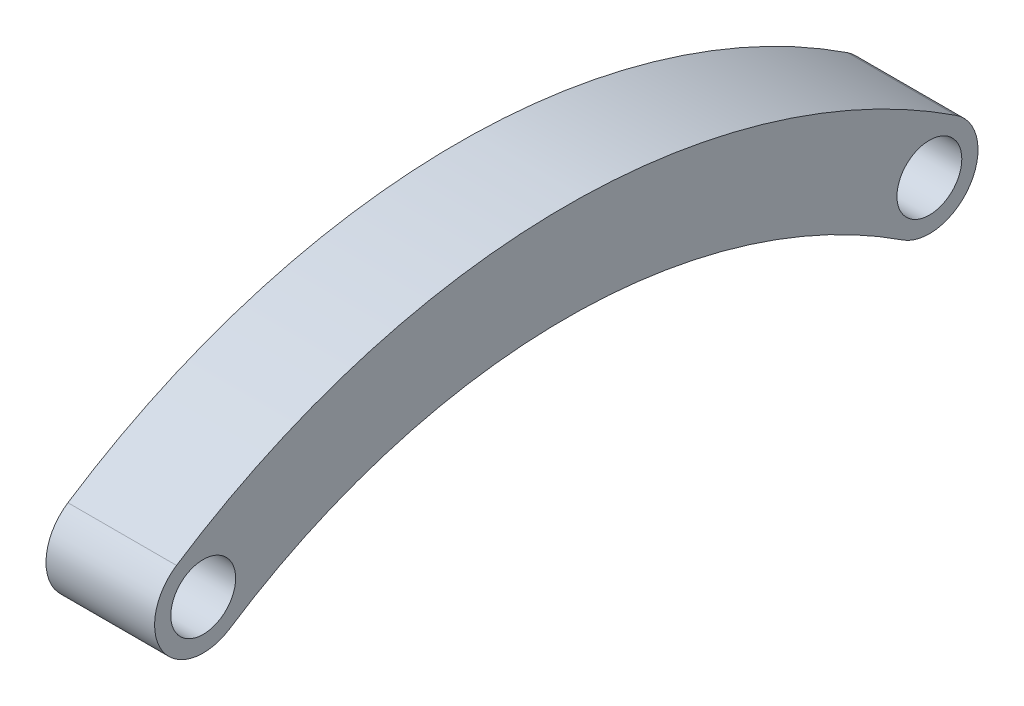
ISO-10303-21;
HEADER;
FILE_DESCRIPTION(('STEP AP214'),'2;1');
FILE_NAME('part.step','',(''),(''),'','','');
FILE_SCHEMA(('AUTOMOTIVE_DESIGN { 1 0 10303 214 1 1 1 1 }'));
ENDSEC;
DATA;
#1=APPLICATION_CONTEXT('core data for automotive mechanical design processes');
#2=APPLICATION_PROTOCOL_DEFINITION('international standard','automotive_design',2000,#1);
#3=PRODUCT_CONTEXT('',#1,'mechanical');
#4=PRODUCT('Part','Part','',(#3));
#5=PRODUCT_RELATED_PRODUCT_CATEGORY('part','',(#4));
#6=PRODUCT_DEFINITION_FORMATION('','',#4);
#7=PRODUCT_DEFINITION_CONTEXT('part definition',#1,'design');
#8=PRODUCT_DEFINITION('design','',#6,#7);
#9=PRODUCT_DEFINITION_SHAPE('','',#8);
#10=(LENGTH_UNIT() NAMED_UNIT(*) SI_UNIT(.MILLI.,.METRE.));
#11=(NAMED_UNIT(*) PLANE_ANGLE_UNIT() SI_UNIT($,.RADIAN.));
#12=(NAMED_UNIT(*) SI_UNIT($,.STERADIAN.) SOLID_ANGLE_UNIT());
#13=UNCERTAINTY_MEASURE_WITH_UNIT(LENGTH_MEASURE(1.E-05),#10,'distance_accuracy_value','');
#14=(GEOMETRIC_REPRESENTATION_CONTEXT(3) GLOBAL_UNCERTAINTY_ASSIGNED_CONTEXT((#13)) GLOBAL_UNIT_ASSIGNED_CONTEXT((#10,
#11,#12)) REPRESENTATION_CONTEXT('',''));
#15=CARTESIAN_POINT('',(0.,0.,0.));
#16=DIRECTION('',(0.,0.,1.));
#17=DIRECTION('',(1.,0.,0.));
#18=AXIS2_PLACEMENT_3D('',#15,#16,#17);
#19=CARTESIAN_POINT('',(3.35,-3.69999999999996,-22.4));
#20=DIRECTION('',(-1.,0.,0.));
#21=DIRECTION('',(0.,0.,1.));
#22=AXIS2_PLACEMENT_3D('',#19,#20,#21);
#23=CYLINDRICAL_SURFACE('',#22,3.);
#24=CARTESIAN_POINT('',(-3.35,-3.69999999999996,-22.4));
#25=DIRECTION('',(1.,0.,0.));
#26=DIRECTION('',(0.,0.,-1.));
#27=AXIS2_PLACEMENT_3D('',#24,#25,#26);
#28=CIRCLE('',#27,3.);
#29=CARTESIAN_POINT('',(-3.35,-6.20728985639803,-20.7527302661666));
#30=VERTEX_POINT('',#29);
#31=CARTESIAN_POINT('',(-3.35,-1.19271014360174,-24.0472697338334));
#32=VERTEX_POINT('',#31);
#33=EDGE_CURVE('E112',#30,#32,#28,.T.);
#34=ORIENTED_EDGE('',*,*,#33,.T.);
#35=DIRECTION('',(-1.,0.,0.));
#36=VECTOR('',#35,1.);
#37=CARTESIAN_POINT('',(3.35,-1.19271014360174,-24.0472697338334));
#38=LINE('',#37,#36);
#39=CARTESIAN_POINT('',(3.35,-1.19271014360174,-24.0472697338334));
#40=VERTEX_POINT('',#39);
#41=EDGE_CURVE('E11',#40,#32,#38,.T.);
#42=ORIENTED_EDGE('',*,*,#41,.F.);
#43=CARTESIAN_POINT('',(3.35,-3.69999999999996,-22.4));
#44=DIRECTION('',(1.,0.,0.));
#45=DIRECTION('',(0.,0.,-1.));
#46=AXIS2_PLACEMENT_3D('',#43,#44,#45);
#47=CIRCLE('',#46,3.);
#48=CARTESIAN_POINT('',(3.35,-6.20728985639803,-20.7527302661666));
#49=VERTEX_POINT('',#48);
#50=EDGE_CURVE('E94',#49,#40,#47,.T.);
#51=ORIENTED_EDGE('',*,*,#50,.F.);
#52=DIRECTION('',(-1.,0.,0.));
#53=VECTOR('',#52,1.);
#54=CARTESIAN_POINT('',(3.35,-6.20728985639803,-20.7527302661666));
#55=LINE('',#54,#53);
#56=EDGE_CURVE('E108',#49,#30,#55,.T.);
#57=ORIENTED_EDGE('',*,*,#56,.T.);
#58=EDGE_LOOP('',(#34,#42,#51,#57));
#59=FACE_BOUND('',#58,.T.);
#60=ADVANCED_FACE('F43',(#59),#23,.T.);
#61=CARTESIAN_POINT('',(3.35,-37.7947761194029,0.));
#62=DIRECTION('',(-1.,0.,0.));
#63=DIRECTION('',(0.,0.,1.));
#64=AXIS2_PLACEMENT_3D('',#61,#62,#63);
#65=CYLINDRICAL_SURFACE('',#64,43.7947761194032);
#66=CARTESIAN_POINT('',(-3.35,-37.7947761194029,0.));
#67=DIRECTION('',(1.,0.,0.));
#68=DIRECTION('',(0.,0.,-1.));
#69=AXIS2_PLACEMENT_3D('',#66,#67,#68);
#70=CIRCLE('',#69,43.7947761194032);
#71=CARTESIAN_POINT('',(-3.35,-1.1927101436019,24.0472697338333));
#72=VERTEX_POINT('',#71);
#73=EDGE_CURVE('E100',#32,#72,#70,.T.);
#74=ORIENTED_EDGE('',*,*,#73,.T.);
#75=DIRECTION('',(-1.,0.,0.));
#76=VECTOR('',#75,1.);
#77=CARTESIAN_POINT('',(3.35,-1.1927101436019,24.0472697338333));
#78=LINE('',#77,#76);
#79=CARTESIAN_POINT('',(3.35,-1.1927101436019,24.0472697338333));
#80=VERTEX_POINT('',#79);
#81=EDGE_CURVE('E52',#80,#72,#78,.T.);
#82=ORIENTED_EDGE('',*,*,#81,.F.);
#83=CARTESIAN_POINT('',(3.35,-37.7947761194029,0.));
#84=DIRECTION('',(1.,0.,0.));
#85=DIRECTION('',(0.,0.,1.));
#86=AXIS2_PLACEMENT_3D('',#83,#84,#85);
#87=CIRCLE('',#86,43.7947761194032);
#88=EDGE_CURVE('E88',#40,#80,#87,.T.);
#89=ORIENTED_EDGE('',*,*,#88,.F.);
#90=ORIENTED_EDGE('',*,*,#41,.T.);
#91=EDGE_LOOP('',(#74,#82,#89,#90));
#92=FACE_BOUND('',#91,.T.);
#93=ADVANCED_FACE('F99',(#92),#65,.T.);
#94=CARTESIAN_POINT('',(3.35,-3.69999999999996,22.4));
#95=DIRECTION('',(-1.,0.,0.));
#96=DIRECTION('',(0.,0.,1.));
#97=AXIS2_PLACEMENT_3D('',#94,#95,#96);
#98=CYLINDRICAL_SURFACE('',#97,3.);
#99=CARTESIAN_POINT('',(-3.35,-3.69999999999996,22.4));
#100=DIRECTION('',(1.,0.,0.));
#101=DIRECTION('',(0.,0.,1.));
#102=AXIS2_PLACEMENT_3D('',#99,#100,#101);
#103=CIRCLE('',#102,3.);
#104=CARTESIAN_POINT('',(-3.35,-6.20728985639803,20.7527302661666));
#105=VERTEX_POINT('',#104);
#106=EDGE_CURVE('E119',#72,#105,#103,.T.);
#107=ORIENTED_EDGE('',*,*,#106,.T.);
#108=DIRECTION('',(-1.,0.,0.));
#109=VECTOR('',#108,1.);
#110=CARTESIAN_POINT('',(3.35,-6.20728985639803,20.7527302661666));
#111=LINE('',#110,#109);
#112=CARTESIAN_POINT('',(3.35,-6.20728985639803,20.7527302661666));
#113=VERTEX_POINT('',#112);
#114=EDGE_CURVE('E103',#113,#105,#111,.T.);
#115=ORIENTED_EDGE('',*,*,#114,.F.);
#116=CARTESIAN_POINT('',(3.35,-3.69999999999996,22.4));
#117=DIRECTION('',(1.,0.,0.));
#118=DIRECTION('',(0.,0.,1.));
#119=AXIS2_PLACEMENT_3D('',#116,#117,#118);
#120=CIRCLE('',#119,3.);
#121=EDGE_CURVE('E91',#80,#113,#120,.T.);
#122=ORIENTED_EDGE('',*,*,#121,.F.);
#123=ORIENTED_EDGE('',*,*,#81,.T.);
#124=EDGE_LOOP('',(#107,#115,#122,#123));
#125=FACE_BOUND('',#124,.T.);
#126=ADVANCED_FACE('F104',(#125),#98,.T.);
#127=CARTESIAN_POINT('',(3.35,-37.7947761194029,0.));
#128=DIRECTION('',(-1.,0.,0.));
#129=DIRECTION('',(0.,0.,1.));
#130=AXIS2_PLACEMENT_3D('',#127,#128,#129);
#131=CYLINDRICAL_SURFACE('',#130,37.794776119403);
#132=CARTESIAN_POINT('',(-3.35,-37.7947761194029,0.));
#133=DIRECTION('',(-1.,0.,0.));
#134=DIRECTION('',(0.,0.,1.));
#135=AXIS2_PLACEMENT_3D('',#132,#133,#134);
#136=CIRCLE('',#135,37.794776119403);
#137=EDGE_CURVE('E77',#105,#30,#136,.T.);
#138=ORIENTED_EDGE('',*,*,#137,.T.);
#139=ORIENTED_EDGE('',*,*,#56,.F.);
#140=CARTESIAN_POINT('',(3.35,-37.7947761194029,0.));
#141=DIRECTION('',(-1.,0.,0.));
#142=DIRECTION('',(0.,0.,-1.));
#143=AXIS2_PLACEMENT_3D('',#140,#141,#142);
#144=CIRCLE('',#143,37.794776119403);
#145=EDGE_CURVE('E60',#113,#49,#144,.T.);
#146=ORIENTED_EDGE('',*,*,#145,.F.);
#147=ORIENTED_EDGE('',*,*,#114,.T.);
#148=EDGE_LOOP('',(#138,#139,#146,#147));
#149=FACE_BOUND('',#148,.T.);
#150=ADVANCED_FACE('F127',(#149),#131,.F.);
#151=CARTESIAN_POINT('',(3.35,-20.7473880597014,-11.2));
#152=DIRECTION('',(1.,0.,0.));
#153=DIRECTION('',(0.,0.,-1.));
#154=AXIS2_PLACEMENT_3D('',#151,#152,#153);
#155=PLANE('',#154);
#156=CARTESIAN_POINT('',(3.35,-3.69999999999996,22.4));
#157=DIRECTION('',(1.,0.,0.));
#158=DIRECTION('',(0.,0.,-1.));
#159=AXIS2_PLACEMENT_3D('',#156,#157,#158);
#160=CIRCLE('',#159,2.);
#161=CARTESIAN_POINT('',(3.35,-3.69999999999996,20.4));
#162=VERTEX_POINT('',#161);
#163=EDGE_CURVE('E135',#162,#162,#160,.T.);
#164=ORIENTED_EDGE('',*,*,#163,.F.);
#165=EDGE_LOOP('',(#164));
#166=FACE_BOUND('',#165,.T.);
#167=CARTESIAN_POINT('',(3.35,-3.69999999999996,-22.4));
#168=DIRECTION('',(1.,0.,0.));
#169=DIRECTION('',(0.,0.,1.));
#170=AXIS2_PLACEMENT_3D('',#167,#168,#169);
#171=CIRCLE('',#170,2.);
#172=CARTESIAN_POINT('',(3.35,-3.69999999999996,-20.4));
#173=VERTEX_POINT('',#172);
#174=EDGE_CURVE('E131',#173,#173,#171,.T.);
#175=ORIENTED_EDGE('',*,*,#174,.F.);
#176=EDGE_LOOP('',(#175));
#177=FACE_BOUND('',#176,.T.);
#178=ORIENTED_EDGE('',*,*,#50,.T.);
#179=ORIENTED_EDGE('',*,*,#88,.T.);
#180=ORIENTED_EDGE('',*,*,#121,.T.);
#181=ORIENTED_EDGE('',*,*,#145,.T.);
#182=EDGE_LOOP('',(#178,#179,#180,#181));
#183=FACE_BOUND('',#182,.T.);
#184=ADVANCED_FACE('F89',(#166,#177,#183),#155,.T.);
#185=CARTESIAN_POINT('',(-3.35,-20.7473880597014,-11.2));
#186=DIRECTION('',(1.,0.,0.));
#187=DIRECTION('',(0.,0.,-1.));
#188=AXIS2_PLACEMENT_3D('',#185,#186,#187);
#189=PLANE('',#188);
#190=CARTESIAN_POINT('',(-3.35,-3.69999999999996,22.4));
#191=DIRECTION('',(1.,0.,0.));
#192=DIRECTION('',(0.,0.,-1.));
#193=AXIS2_PLACEMENT_3D('',#190,#191,#192);
#194=CIRCLE('',#193,2.);
#195=CARTESIAN_POINT('',(-3.35,-3.69999999999996,20.4));
#196=VERTEX_POINT('',#195);
#197=EDGE_CURVE('E116',#196,#196,#194,.F.);
#198=ORIENTED_EDGE('',*,*,#197,.F.);
#199=EDGE_LOOP('',(#198));
#200=FACE_BOUND('',#199,.T.);
#201=CARTESIAN_POINT('',(-3.35,-3.69999999999996,-22.4));
#202=DIRECTION('',(1.,0.,0.));
#203=DIRECTION('',(0.,0.,-1.));
#204=AXIS2_PLACEMENT_3D('',#201,#202,#203);
#205=CIRCLE('',#204,2.);
#206=CARTESIAN_POINT('',(-3.35,-3.69999999999996,-24.4));
#207=VERTEX_POINT('',#206);
#208=EDGE_CURVE('E136',#207,#207,#205,.F.);
#209=ORIENTED_EDGE('',*,*,#208,.F.);
#210=EDGE_LOOP('',(#209));
#211=FACE_BOUND('',#210,.T.);
#212=ORIENTED_EDGE('',*,*,#33,.F.);
#213=ORIENTED_EDGE('',*,*,#137,.F.);
#214=ORIENTED_EDGE('',*,*,#106,.F.);
#215=ORIENTED_EDGE('',*,*,#73,.F.);
#216=EDGE_LOOP('',(#212,#213,#214,#215));
#217=FACE_BOUND('',#216,.T.);
#218=ADVANCED_FACE('F151',(#200,#211,#217),#189,.F.);
#219=CARTESIAN_POINT('',(-9.00685424949239,-3.69999999999996,-22.4));
#220=DIRECTION('',(1.,0.,0.));
#221=DIRECTION('',(0.,0.,-1.));
#222=AXIS2_PLACEMENT_3D('',#219,#220,#221);
#223=CYLINDRICAL_SURFACE('',#222,2.);
#224=ORIENTED_EDGE('',*,*,#208,.T.);
#225=EDGE_LOOP('',(#224));
#226=FACE_BOUND('',#225,.T.);
#227=ORIENTED_EDGE('',*,*,#174,.T.);
#228=EDGE_LOOP('',(#227));
#229=FACE_BOUND('',#228,.T.);
#230=ADVANCED_FACE('F155',(#226,#229),#223,.F.);
#231=CARTESIAN_POINT('',(-9.00685424949239,-3.69999999999996,22.4));
#232=DIRECTION('',(1.,0.,0.));
#233=DIRECTION('',(0.,0.,-1.));
#234=AXIS2_PLACEMENT_3D('',#231,#232,#233);
#235=CYLINDRICAL_SURFACE('',#234,2.);
#236=ORIENTED_EDGE('',*,*,#197,.T.);
#237=EDGE_LOOP('',(#236));
#238=FACE_BOUND('',#237,.T.);
#239=ORIENTED_EDGE('',*,*,#163,.T.);
#240=EDGE_LOOP('',(#239));
#241=FACE_BOUND('',#240,.T.);
#242=ADVANCED_FACE('F147',(#238,#241),#235,.F.);
#243=CLOSED_SHELL('',(#60,#93,#126,#150,#184,#218,#230,#242));
#244=MANIFOLD_SOLID_BREP('B2',#243);
#245=ADVANCED_BREP_SHAPE_REPRESENTATION('',(#18,#244),#14);
#246=SHAPE_DEFINITION_REPRESENTATION(#9,#245);
ENDSEC;
END-ISO-10303-21;
